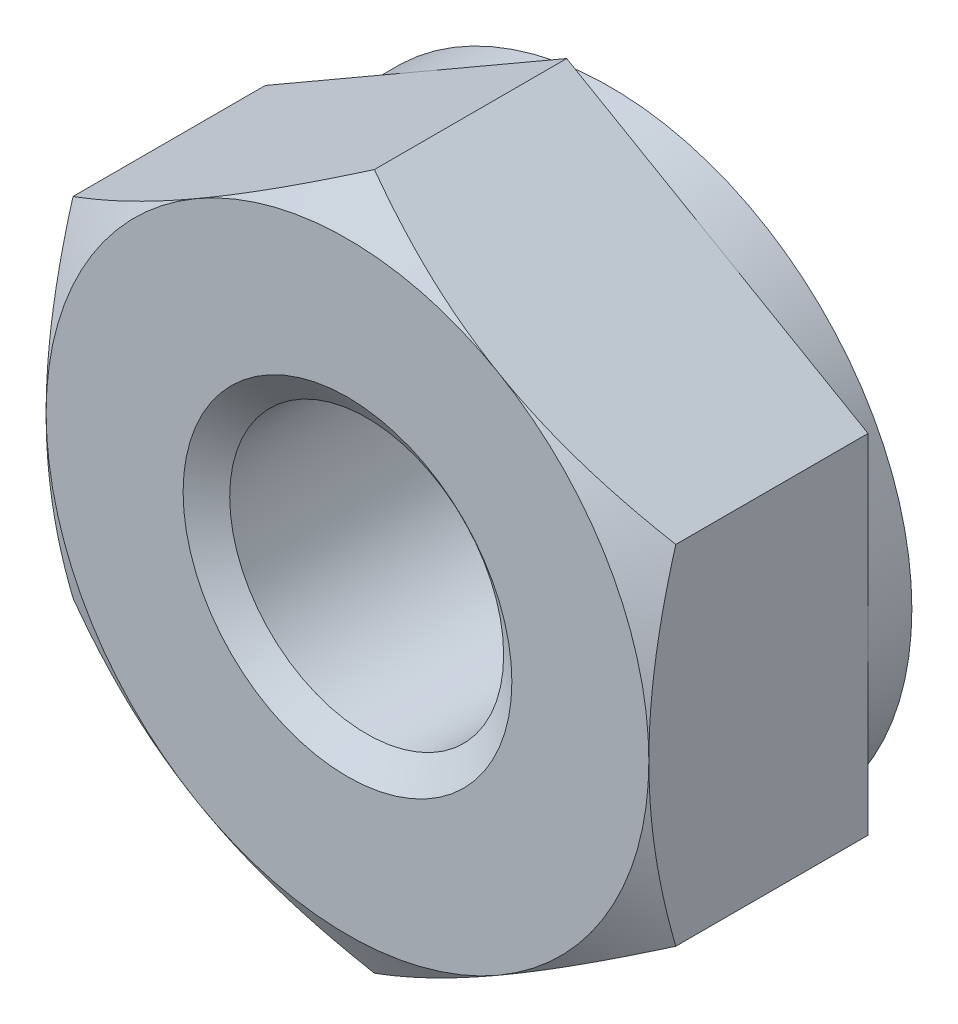
ISO-10303-21;
HEADER;
FILE_DESCRIPTION(('STEP AP214'),'2;1');
FILE_NAME('part.step','',(''),(''),'','','');
FILE_SCHEMA(('AUTOMOTIVE_DESIGN { 1 0 10303 214 1 1 1 1 }'));
ENDSEC;
DATA;
#1=APPLICATION_CONTEXT('core data for automotive mechanical design processes');
#2=APPLICATION_PROTOCOL_DEFINITION('international standard','automotive_design',2000,#1);
#3=PRODUCT_CONTEXT('',#1,'mechanical');
#4=PRODUCT('Part','Part','',(#3));
#5=PRODUCT_RELATED_PRODUCT_CATEGORY('part','',(#4));
#6=PRODUCT_DEFINITION_FORMATION('','',#4);
#7=PRODUCT_DEFINITION_CONTEXT('part definition',#1,'design');
#8=PRODUCT_DEFINITION('design','',#6,#7);
#9=PRODUCT_DEFINITION_SHAPE('','',#8);
#10=(LENGTH_UNIT() NAMED_UNIT(*) SI_UNIT(.MILLI.,.METRE.));
#11=(NAMED_UNIT(*) PLANE_ANGLE_UNIT() SI_UNIT($,.RADIAN.));
#12=(NAMED_UNIT(*) SI_UNIT($,.STERADIAN.) SOLID_ANGLE_UNIT());
#13=UNCERTAINTY_MEASURE_WITH_UNIT(LENGTH_MEASURE(1.E-05),#10,'distance_accuracy_value','');
#14=(GEOMETRIC_REPRESENTATION_CONTEXT(3) GLOBAL_UNCERTAINTY_ASSIGNED_CONTEXT((#13)) GLOBAL_UNIT_ASSIGNED_CONTEXT((#10,
#11,#12)) REPRESENTATION_CONTEXT('',''));
#15=CARTESIAN_POINT('',(0.,0.,0.));
#16=DIRECTION('',(0.,0.,1.));
#17=DIRECTION('',(1.,0.,0.));
#18=AXIS2_PLACEMENT_3D('',#15,#16,#17);
#19=CARTESIAN_POINT('',(0.,0.,-2.4));
#20=DIRECTION('',(0.,0.,1.));
#21=DIRECTION('',(1.,0.,0.));
#22=AXIS2_PLACEMENT_3D('',#19,#20,#21);
#23=CYLINDRICAL_SURFACE('',#22,1.25);
#24=CARTESIAN_POINT('',(0.,0.,-0.175051884552426));
#25=DIRECTION('',(0.,0.,1.));
#26=DIRECTION('',(1.,0.,0.));
#27=AXIS2_PLACEMENT_3D('',#24,#25,#26);
#28=CIRCLE('',#27,1.25);
#29=CARTESIAN_POINT('',(1.25,0.,-0.175051884552426));
#30=VERTEX_POINT('',#29);
#31=EDGE_CURVE('E151',#30,#30,#28,.F.);
#32=ORIENTED_EDGE('',*,*,#31,.F.);
#33=EDGE_LOOP('',(#32));
#34=FACE_BOUND('',#33,.T.);
#35=CARTESIAN_POINT('',(0.,0.,-2.19954811544757));
#36=DIRECTION('',(0.,0.,-1.));
#37=DIRECTION('',(-1.,0.,0.));
#38=AXIS2_PLACEMENT_3D('',#35,#36,#37);
#39=CIRCLE('',#38,1.25);
#40=CARTESIAN_POINT('',(-1.25,0.,-2.19954811544757));
#41=VERTEX_POINT('',#40);
#42=EDGE_CURVE('E39',#41,#41,#39,.F.);
#43=ORIENTED_EDGE('',*,*,#42,.F.);
#44=EDGE_LOOP('',(#43));
#45=FACE_BOUND('',#44,.T.);
#46=ADVANCED_FACE('F34',(#34,#45),#23,.F.);
#47=CARTESIAN_POINT('',(0.,3.17542648054295,-2.4));
#48=DIRECTION('',(0.,0.,-1.));
#49=DIRECTION('',(-1.,0.,0.));
#50=AXIS2_PLACEMENT_3D('',#47,#48,#49);
#51=PLANE('',#50);
#52=CARTESIAN_POINT('',(0.,0.,-2.4));
#53=DIRECTION('',(0.,0.,-1.));
#54=DIRECTION('',(-1.,0.,0.));
#55=AXIS2_PLACEMENT_3D('',#52,#53,#54);
#56=CIRCLE('',#55,2.75);
#57=CARTESIAN_POINT('',(-2.75,0.,-2.4));
#58=VERTEX_POINT('',#57);
#59=EDGE_CURVE('E278',#58,#58,#56,.F.);
#60=ORIENTED_EDGE('',*,*,#59,.F.);
#61=EDGE_LOOP('',(#60));
#62=FACE_BOUND('',#61,.T.);
#63=CARTESIAN_POINT('',(0.,0.,-2.4));
#64=DIRECTION('',(0.,0.,-1.));
#65=DIRECTION('',(-1.,0.,0.));
#66=AXIS2_PLACEMENT_3D('',#63,#64,#65);
#67=CIRCLE('',#66,1.5);
#68=CARTESIAN_POINT('',(-1.5,0.,-2.4));
#69=VERTEX_POINT('',#68);
#70=EDGE_CURVE('E298',#69,#69,#67,.F.);
#71=ORIENTED_EDGE('',*,*,#70,.T.);
#72=EDGE_LOOP('',(#71));
#73=FACE_BOUND('',#72,.T.);
#74=ADVANCED_FACE('F230',(#62,#73),#51,.T.);
#75=CARTESIAN_POINT('',(0.,3.17542648054295,0.));
#76=DIRECTION('',(0.,0.,-1.));
#77=DIRECTION('',(-1.,0.,0.));
#78=AXIS2_PLACEMENT_3D('',#75,#76,#77);
#79=PLANE('',#78);
#80=CARTESIAN_POINT('',(0.,0.,0.));
#81=DIRECTION('',(0.,0.,-1.));
#82=DIRECTION('',(-1.,0.,0.));
#83=AXIS2_PLACEMENT_3D('',#80,#81,#82);
#84=CIRCLE('',#83,2.75);
#85=CARTESIAN_POINT('',(-1.37500000000002,2.3815698604072,0.));
#86=VERTEX_POINT('',#85);
#87=CARTESIAN_POINT('',(-2.75,0.,0.));
#88=VERTEX_POINT('',#87);
#89=EDGE_CURVE('E46',#86,#88,#84,.F.);
#90=ORIENTED_EDGE('',*,*,#89,.T.);
#91=CARTESIAN_POINT('',(-1.37500000000003,-2.38156986040719,0.));
#92=VERTEX_POINT('',#91);
#93=EDGE_CURVE('E11',#88,#92,#84,.F.);
#94=ORIENTED_EDGE('',*,*,#93,.T.);
#95=CARTESIAN_POINT('',(1.37500000000001,-2.3815698604072,0.));
#96=VERTEX_POINT('',#95);
#97=EDGE_CURVE('E44',#92,#96,#84,.F.);
#98=ORIENTED_EDGE('',*,*,#97,.T.);
#99=CARTESIAN_POINT('',(2.75,0.,0.));
#100=VERTEX_POINT('',#99);
#101=EDGE_CURVE('E130',#96,#100,#84,.F.);
#102=ORIENTED_EDGE('',*,*,#101,.T.);
#103=CARTESIAN_POINT('',(0.,0.,0.));
#104=DIRECTION('',(0.,0.,1.));
#105=DIRECTION('',(1.,0.,0.));
#106=AXIS2_PLACEMENT_3D('',#103,#104,#105);
#107=CIRCLE('',#106,2.75);
#108=CARTESIAN_POINT('',(1.37500000000003,2.38156986040719,0.));
#109=VERTEX_POINT('',#108);
#110=EDGE_CURVE('E142',#100,#109,#107,.T.);
#111=ORIENTED_EDGE('',*,*,#110,.T.);
#112=EDGE_CURVE('E157',#109,#86,#84,.F.);
#113=ORIENTED_EDGE('',*,*,#112,.T.);
#114=EDGE_LOOP('',(#90,#94,#98,#102,#111,#113));
#115=FACE_BOUND('',#114,.T.);
#116=CARTESIAN_POINT('',(0.,0.,0.));
#117=DIRECTION('',(0.,0.,1.));
#118=DIRECTION('',(1.,0.,0.));
#119=AXIS2_PLACEMENT_3D('',#116,#117,#118);
#120=CIRCLE('',#119,1.5);
#121=CARTESIAN_POINT('',(1.5,0.,0.));
#122=VERTEX_POINT('',#121);
#123=EDGE_CURVE('E297',#122,#122,#120,.T.);
#124=ORIENTED_EDGE('',*,*,#123,.F.);
#125=EDGE_LOOP('',(#124));
#126=FACE_BOUND('',#125,.T.);
#127=ADVANCED_FACE('F154',(#115,#126),#79,.F.);
#128=CARTESIAN_POINT('',(0.,3.17542648054295,-2.4));
#129=DIRECTION('',(-0.500000000000006,0.866025403784435,0.));
#130=DIRECTION('',(-0.866025403784435,-0.500000000000006,0.));
#131=AXIS2_PLACEMENT_3D('',#128,#129,#130);
#132=PLANE('',#131);
#133=DIRECTION('',(0.,0.,1.));
#134=VECTOR('',#133,1.);
#135=CARTESIAN_POINT('',(-2.75,1.58771324027146,-2.4));
#136=LINE('',#135,#134);
#137=CARTESIAN_POINT('',(-2.75,1.58771324027146,-2.));
#138=VERTEX_POINT('',#137);
#139=CARTESIAN_POINT('',(-2.75,1.58771324027146,-0.24562009306187));
#140=VERTEX_POINT('',#139);
#141=EDGE_CURVE('E287',#138,#140,#136,.T.);
#142=ORIENTED_EDGE('',*,*,#141,.T.);
#143=CARTESIAN_POINT('',(-2.7502,1.58759777021762,-0.245686763364756));
#144=CARTESIAN_POINT('',(-2.62935077934009,1.65737010029697,-0.205387662249259));
#145=CARTESIAN_POINT('',(-2.50745839737737,1.72774469983532,-0.168736902597658));
#146=CARTESIAN_POINT('',(-2.26156287327211,1.86971254687002,-0.104762182969798));
#147=CARTESIAN_POINT('',(-2.13755536142615,1.94130831721582,-0.0774608556744947));
#148=CARTESIAN_POINT('',(-1.89107720202406,2.08361254889598,-0.0349617452941148));
#149=CARTESIAN_POINT('',(-1.76864448141259,2.15429911309863,-0.0194811186224561));
#150=CARTESIAN_POINT('',(-1.52320285763109,2.29600490065922,-0.000999397369939625));
#151=CARTESIAN_POINT('',(-1.4001948467671,2.36702360884403,0.00201700053740062));
#152=CARTESIAN_POINT('',(-1.17034121338921,2.49972966594897,-0.00425314542854701));
#153=CARTESIAN_POINT('',(-1.06346120874598,2.56143686540072,-0.012000154276703));
#154=CARTESIAN_POINT('',(-0.850397532665255,2.68444923614047,-0.0365551810643565));
#155=CARTESIAN_POINT('',(-0.744214598351115,2.74575398185008,-0.0533715896505727));
#156=CARTESIAN_POINT('',(-0.530711510606819,2.86902004703207,-0.0954119223459602));
#157=CARTESIAN_POINT('',(-0.423418383857147,2.93096576264319,-0.120814080687235));
#158=CARTESIAN_POINT('',(-0.210432520715949,3.05393320806135,-0.178467225839988));
#159=CARTESIAN_POINT('',(-0.104737054973347,3.11495651365996,-0.210704663298989));
#160=CARTESIAN_POINT('',(0.000200000000000649,3.17554195059679,-0.245686763364768));
#161=B_SPLINE_CURVE_WITH_KNOTS('',3,(#143,#144,#145,#146,#147,#148,#149,#150,#151,#152,#153,
#154,#155,#156,#157,#158,#159,#160),.UNSPECIFIED.,.F.,.F.,(4,2,2,2,2,2,2,2,4),(0.,
0.435912828725888,0.87287355711633,1.29901931904671,1.72464171213573,2.09526089052938,
2.46622354066375,2.84541551798558,3.22386274754526),.UNSPECIFIED.);
#162=EDGE_CURVE('E58',#140,#86,#161,.T.);
#163=ORIENTED_EDGE('',*,*,#162,.T.);
#164=CARTESIAN_POINT('',(0.,3.17542648054296,-0.24562009306187));
#165=VERTEX_POINT('',#164);
#166=EDGE_CURVE('E166',#86,#165,#161,.T.);
#167=ORIENTED_EDGE('',*,*,#166,.T.);
#168=DIRECTION('',(0.,0.,1.));
#169=VECTOR('',#168,1.);
#170=CARTESIAN_POINT('',(0.,3.17542648054295,-2.4));
#171=LINE('',#170,#169);
#172=CARTESIAN_POINT('',(0.,3.17542648054295,-2.));
#173=VERTEX_POINT('',#172);
#174=EDGE_CURVE('E275',#173,#165,#171,.T.);
#175=ORIENTED_EDGE('',*,*,#174,.F.);
#176=DIRECTION('',(-0.866025403784435,-0.500000000000006,0.));
#177=VECTOR('',#176,1.);
#178=CARTESIAN_POINT('',(0.,3.17542648054295,-2.));
#179=LINE('',#178,#177);
#180=CARTESIAN_POINT('',(-1.37500000000002,2.3815698604072,-2.00000000000001));
#181=VERTEX_POINT('',#180);
#182=EDGE_CURVE('E263',#173,#181,#179,.T.);
#183=ORIENTED_EDGE('',*,*,#182,.T.);
#184=EDGE_CURVE('E259',#181,#138,#179,.T.);
#185=ORIENTED_EDGE('',*,*,#184,.T.);
#186=EDGE_LOOP('',(#142,#163,#167,#175,#183,#185));
#187=FACE_BOUND('',#186,.T.);
#188=ADVANCED_FACE('F36',(#187),#132,.T.);
#189=CARTESIAN_POINT('',(2.75,1.58771324027144,-2.4));
#190=DIRECTION('',(0.500000000000011,0.866025403784433,0.));
#191=DIRECTION('',(-0.866025403784433,0.500000000000011,0.));
#192=AXIS2_PLACEMENT_3D('',#189,#190,#191);
#193=PLANE('',#192);
#194=ORIENTED_EDGE('',*,*,#174,.T.);
#195=CARTESIAN_POINT('',(-0.000199999999999266,3.17554195059679,-0.245686763364768));
#196=CARTESIAN_POINT('',(0.120649220659906,3.10576962051744,-0.20538766224927));
#197=CARTESIAN_POINT('',(0.242541602622633,3.03539502097909,-0.168736902597668));
#198=CARTESIAN_POINT('',(0.488437126727891,2.89342717394439,-0.104762182969805));
#199=CARTESIAN_POINT('',(0.612444638573854,2.82183140359859,-0.0774608556745));
#200=CARTESIAN_POINT('',(0.858922797975941,2.67952717191843,-0.0349617452941173));
#201=CARTESIAN_POINT('',(0.981355518587414,2.60884060771577,-0.0194811186224572));
#202=CARTESIAN_POINT('',(1.22679714236891,2.46713482015518,-0.000999397369937717));
#203=CARTESIAN_POINT('',(1.34980515323291,2.39611611197037,0.00201700053740402));
#204=CARTESIAN_POINT('',(1.57965878661079,2.26341005486543,-0.00425314542854105));
#205=CARTESIAN_POINT('',(1.68653879125402,2.20170285541368,-0.0120001542766958));
#206=CARTESIAN_POINT('',(1.89960246733475,2.07869048467393,-0.036555181064347));
#207=CARTESIAN_POINT('',(2.00578540164888,2.01738573896432,-0.0533715896505621));
#208=CARTESIAN_POINT('',(2.21928848939318,1.89411967378233,-0.0954119223459474));
#209=CARTESIAN_POINT('',(2.32658161614285,1.83217395817121,-0.120814080687222));
#210=CARTESIAN_POINT('',(2.53956747928405,1.70920651275305,-0.178467225839972));
#211=CARTESIAN_POINT('',(2.64526294502665,1.64818320715443,-0.210704663298972));
#212=CARTESIAN_POINT('',(2.7502,1.5875977702176,-0.24568676336475));
#213=B_SPLINE_CURVE_WITH_KNOTS('',3,(#195,#196,#197,#198,#199,#200,#201,#202,#203,#204,#205,
#206,#207,#208,#209,#210,#211,#212),.UNSPECIFIED.,.F.,.F.,(4,2,2,2,2,2,2,2,4),(0.,
0.43591282872589,0.872873557116336,1.29901931904672,1.72464171213574,2.09526089052939,
2.46622354066376,2.84541551798559,3.22386274754526),.UNSPECIFIED.);
#214=EDGE_CURVE('E163',#165,#109,#213,.T.);
#215=ORIENTED_EDGE('',*,*,#214,.T.);
#216=CARTESIAN_POINT('',(2.75,1.5877132402715,-0.24562009306187));
#217=VERTEX_POINT('',#216);
#218=EDGE_CURVE('E145',#109,#217,#213,.T.);
#219=ORIENTED_EDGE('',*,*,#218,.T.);
#220=DIRECTION('',(0.,0.,1.));
#221=VECTOR('',#220,1.);
#222=CARTESIAN_POINT('',(2.75,1.58771324027144,-2.4));
#223=LINE('',#222,#221);
#224=CARTESIAN_POINT('',(2.75,1.58771324027144,-2.));
#225=VERTEX_POINT('',#224);
#226=EDGE_CURVE('E162',#225,#217,#223,.T.);
#227=ORIENTED_EDGE('',*,*,#226,.F.);
#228=DIRECTION('',(-0.866025403784433,0.500000000000011,0.));
#229=VECTOR('',#228,1.);
#230=CARTESIAN_POINT('',(2.75,1.58771324027144,-2.));
#231=LINE('',#230,#229);
#232=CARTESIAN_POINT('',(1.37500000000003,2.38156986040718,-2.00000000000001));
#233=VERTEX_POINT('',#232);
#234=EDGE_CURVE('E271',#225,#233,#231,.T.);
#235=ORIENTED_EDGE('',*,*,#234,.T.);
#236=EDGE_CURVE('E267',#233,#173,#231,.T.);
#237=ORIENTED_EDGE('',*,*,#236,.T.);
#238=EDGE_LOOP('',(#194,#215,#219,#227,#235,#237));
#239=FACE_BOUND('',#238,.T.);
#240=ADVANCED_FACE('F243',(#239),#193,.T.);
#241=CARTESIAN_POINT('',(2.75,1.58771324027144,-2.4));
#242=DIRECTION('',(-1.,0.,0.));
#243=DIRECTION('',(0.,0.,1.));
#244=AXIS2_PLACEMENT_3D('',#241,#242,#243);
#245=PLANE('',#244);
#246=CARTESIAN_POINT('',(2.75,-4.2108494930968,-1.31594843960295));
#247=CARTESIAN_POINT('',(2.75,-4.09010894214094,-1.25759993615226));
#248=CARTESIAN_POINT('',(2.75,-3.96908292065513,-1.1998314651176));
#249=CARTESIAN_POINT('',(2.75,-3.72630558284848,-1.08578603842306));
#250=CARTESIAN_POINT('',(2.75,-3.60455414536204,-1.02950934100248));
#251=CARTESIAN_POINT('',(2.75,-3.35951393034359,-0.918482443352771));
#252=CARTESIAN_POINT('',(2.75,-3.2362203423644,-0.863742821605852));
#253=CARTESIAN_POINT('',(2.75,-2.98861980138747,-0.756614777476467));
#254=CARTESIAN_POINT('',(2.75,-2.86431290161186,-0.704226232536776));
#255=CARTESIAN_POINT('',(2.75,-2.61294485887176,-0.601803572146136));
#256=CARTESIAN_POINT('',(2.75,-2.48586863815658,-0.551806257898405));
#257=CARTESIAN_POINT('',(2.75,-2.23021732171545,-0.455727408784612));
#258=CARTESIAN_POINT('',(2.75,-2.10164206103367,-0.409646309576982));
#259=CARTESIAN_POINT('',(2.75,-1.84305218799471,-0.32263807704624));
#260=CARTESIAN_POINT('',(2.75,-1.71304130052587,-0.281699986413897));
#261=CARTESIAN_POINT('',(2.75,-1.45117125062151,-0.206307307624355));
#262=CARTESIAN_POINT('',(2.75,-1.31931268690206,-0.171850669152774));
#263=CARTESIAN_POINT('',(2.75,-1.05365722480016,-0.111093671530909));
#264=CARTESIAN_POINT('',(2.75,-0.919859820217627,-0.0847954840951257));
#265=CARTESIAN_POINT('',(2.75,-0.650651874037416,-0.0421260371966137));
#266=CARTESIAN_POINT('',(2.75,-0.51524133101363,-0.0257547865105446));
#267=CARTESIAN_POINT('',(2.75,-0.244373242869245,-0.00438749654023727));
#268=CARTESIAN_POINT('',(2.75,-0.108921526377167,0.000680556773217004));
#269=CARTESIAN_POINT('',(2.75,0.161887058855101,-0.000827795632669049));
#270=CARTESIAN_POINT('',(2.75,0.297243943089608,-0.00740117868554976));
#271=CARTESIAN_POINT('',(2.75,0.528385436717509,-0.0281041300468381));
#272=CARTESIAN_POINT('',(2.75,0.624425050137466,-0.0395376410301817));
#273=CARTESIAN_POINT('',(2.75,0.815762399811508,-0.0675217196133428));
#274=CARTESIAN_POINT('',(2.75,0.91106001663193,-0.0840730942276734));
#275=CARTESIAN_POINT('',(2.75,1.19576218748913,-0.140535361278273));
#276=CARTESIAN_POINT('',(2.75,1.38383224738493,-0.187239859417281));
#277=CARTESIAN_POINT('',(2.75,1.66525048947481,-0.267792497030563));
#278=CARTESIAN_POINT('',(2.75,1.76006556248554,-0.296803334995485));
#279=CARTESIAN_POINT('',(2.75,1.94870609382211,-0.357695648906571));
#280=CARTESIAN_POINT('',(2.75,2.04253218553692,-0.389575144878486));
#281=CARTESIAN_POINT('',(2.75,2.2288024035498,-0.455541418186429));
#282=CARTESIAN_POINT('',(2.75,2.32125133588447,-0.489614761455512));
#283=CARTESIAN_POINT('',(2.75,2.50543192042624,-0.559761368231088));
#284=CARTESIAN_POINT('',(2.75,2.59716326539574,-0.595835440037296));
#285=CARTESIAN_POINT('',(2.75,2.68856293053341,-0.632712441997461));
#286=B_SPLINE_CURVE_WITH_KNOTS('',3,(#246,#247,#248,#249,#250,#251,#252,#253,#254,#255,#256,
#257,#258,#259,#260,#261,#262,#263,#264,#265,#266,#267,#268,#269,#270,#271,#272,#273,#274,#275,
#276,#277,#278,#279,#280,#281,#282,#283,#284,#285),.UNSPECIFIED.,.F.,.F.,(4,2,2,2,2,2,2,2,2,2,2,
2,2,2,2,2,2,2,2,4),(0.,0.402305607365937,0.804680408536997,1.20935783819118,1.61401414820819,
2.0236383818577,2.43330812457349,2.84208969479601,3.25074173456637,3.65950246109144,
4.06826354901185,4.47441284024651,4.88045669141173,5.17046846817547,5.46052599902453,
6.04107275309883,6.33851131304661,6.63574613017454,6.93130791005792,7.22698998004822),.UNSPECIFIED.);
#287=CARTESIAN_POINT('',(2.74999999999999,-1.58771324027152,-0.24562009306187));
#288=VERTEX_POINT('',#287);
#289=EDGE_CURVE('E126',#288,#100,#286,.T.);
#290=ORIENTED_EDGE('',*,*,#289,.F.);
#291=DIRECTION('',(0.,0.,1.));
#292=VECTOR('',#291,1.);
#293=CARTESIAN_POINT('',(2.75,-1.58771324027151,-2.4));
#294=LINE('',#293,#292);
#295=CARTESIAN_POINT('',(2.75,-1.58771324027151,-2.));
#296=VERTEX_POINT('',#295);
#297=EDGE_CURVE('E280',#296,#288,#294,.T.);
#298=ORIENTED_EDGE('',*,*,#297,.F.);
#299=DIRECTION('',(0.,-1.,0.));
#300=VECTOR('',#299,1.);
#301=CARTESIAN_POINT('',(2.75,1.58771324027144,-2.));
#302=LINE('',#301,#300);
#303=CARTESIAN_POINT('',(2.75,0.,-2.00000000000001));
#304=VERTEX_POINT('',#303);
#305=EDGE_CURVE('E272',#304,#296,#302,.T.);
#306=ORIENTED_EDGE('',*,*,#305,.F.);
#307=EDGE_CURVE('E274',#225,#304,#302,.T.);
#308=ORIENTED_EDGE('',*,*,#307,.F.);
#309=ORIENTED_EDGE('',*,*,#226,.T.);
#310=EDGE_CURVE('E139',#100,#217,#286,.T.);
#311=ORIENTED_EDGE('',*,*,#310,.F.);
#312=EDGE_LOOP('',(#290,#298,#306,#308,#309,#311));
#313=FACE_BOUND('',#312,.T.);
#314=ADVANCED_FACE('F159',(#313),#245,.F.);
#315=CARTESIAN_POINT('',(0.,-3.17542648054301,-2.4));
#316=DIRECTION('',(0.500000000000005,-0.866025403784435,0.));
#317=DIRECTION('',(0.866025403784436,0.500000000000006,0.));
#318=AXIS2_PLACEMENT_3D('',#315,#316,#317);
#319=PLANE('',#318);
#320=ORIENTED_EDGE('',*,*,#297,.T.);
#321=CARTESIAN_POINT('',(2.7502,-1.58759777021767,-0.24568676336477));
#322=CARTESIAN_POINT('',(2.62935077934009,-1.65737010029703,-0.205387662249274));
#323=CARTESIAN_POINT('',(2.50745839737736,-1.72774469983538,-0.168736902597674));
#324=CARTESIAN_POINT('',(2.2615628732721,-1.86971254687007,-0.104762182969815));
#325=CARTESIAN_POINT('',(2.13755536142614,-1.94130831721588,-0.0774608556745132));
#326=CARTESIAN_POINT('',(1.89107720202405,-2.08361254889604,-0.0349617452941355));
#327=CARTESIAN_POINT('',(1.76864448141257,-2.15429911309869,-0.0194811186224779));
#328=CARTESIAN_POINT('',(1.52320285763108,-2.29600490065928,-0.000999397369963684));
#329=CARTESIAN_POINT('',(1.40019484676708,-2.36702360884409,0.00201700053737531));
#330=CARTESIAN_POINT('',(1.1703412133892,-2.49972966594903,-0.00425314542857469));
#331=CARTESIAN_POINT('',(1.06346120874597,-2.56143686540078,-0.0120001542767316));
#332=CARTESIAN_POINT('',(0.850397532665241,-2.68444923614053,-0.0365551810643864));
#333=CARTESIAN_POINT('',(0.744214598351102,-2.74575398185014,-0.053371589650603));
#334=CARTESIAN_POINT('',(0.530711510606809,-2.86902004703213,-0.095411922345991));
#335=CARTESIAN_POINT('',(0.423418383857138,-2.93096576264325,-0.120814080687266));
#336=CARTESIAN_POINT('',(0.210432520715943,-3.0539332080614,-0.178467225840019));
#337=CARTESIAN_POINT('',(0.104737054973342,-3.11495651366001,-0.21070466329902));
#338=CARTESIAN_POINT('',(-0.000200000000005155,-3.17554195059684,-0.245686763364798));
#339=B_SPLINE_CURVE_WITH_KNOTS('',3,(#321,#322,#323,#324,#325,#326,#327,#328,#329,#330,#331,
#332,#333,#334,#335,#336,#337,#338),.UNSPECIFIED.,.F.,.F.,(4,2,2,2,2,2,2,2,4),(0.,
0.435912828725891,0.872873557116337,1.29901931904672,1.72464171213575,2.09526089052939,
2.46622354066375,2.84541551798558,3.22386274754525),.UNSPECIFIED.);
#340=EDGE_CURVE('E133',#288,#96,#339,.T.);
#341=ORIENTED_EDGE('',*,*,#340,.T.);
#342=CARTESIAN_POINT('',(0.,-3.17542648054295,-0.24562009306187));
#343=VERTEX_POINT('',#342);
#344=EDGE_CURVE('E173',#96,#343,#339,.T.);
#345=ORIENTED_EDGE('',*,*,#344,.T.);
#346=DIRECTION('',(0.,0.,1.));
#347=VECTOR('',#346,1.);
#348=CARTESIAN_POINT('',(0.,-3.17542648054301,-2.4));
#349=LINE('',#348,#347);
#350=CARTESIAN_POINT('',(0.,-3.17542648054301,-2.));
#351=VERTEX_POINT('',#350);
#352=EDGE_CURVE('E282',#351,#343,#349,.T.);
#353=ORIENTED_EDGE('',*,*,#352,.F.);
#354=DIRECTION('',(0.866025403784436,0.500000000000006,0.));
#355=VECTOR('',#354,1.);
#356=CARTESIAN_POINT('',(0.,-3.17542648054301,-2.));
#357=LINE('',#356,#355);
#358=CARTESIAN_POINT('',(1.37500000000004,-2.38156986040724,-2.00000000000001));
#359=VERTEX_POINT('',#358);
#360=EDGE_CURVE('E264',#351,#359,#357,.T.);
#361=ORIENTED_EDGE('',*,*,#360,.T.);
#362=EDGE_CURVE('E268',#359,#296,#357,.T.);
#363=ORIENTED_EDGE('',*,*,#362,.T.);
#364=EDGE_LOOP('',(#320,#341,#345,#353,#361,#363));
#365=FACE_BOUND('',#364,.T.);
#366=ADVANCED_FACE('F216',(#365),#319,.T.);
#367=CARTESIAN_POINT('',(-2.75,-1.5877132402715,-2.4));
#368=DIRECTION('',(-0.500000000000009,-0.866025403784433,0.));
#369=DIRECTION('',(0.866025403784433,-0.500000000000009,0.));
#370=AXIS2_PLACEMENT_3D('',#367,#368,#369);
#371=PLANE('',#370);
#372=ORIENTED_EDGE('',*,*,#352,.T.);
#373=CARTESIAN_POINT('',(0.000199999999994648,-3.17554195059684,-0.245686763364798));
#374=CARTESIAN_POINT('',(-0.120649220659913,-3.10576962051749,-0.205387662249299));
#375=CARTESIAN_POINT('',(-0.242541602622642,-3.03539502097914,-0.168736902597697));
#376=CARTESIAN_POINT('',(-0.488437126727904,-2.89342717394444,-0.104762182969833));
#377=CARTESIAN_POINT('',(-0.612444638573869,-2.82183140359863,-0.0774608556745285));
#378=CARTESIAN_POINT('',(-0.85892279797596,-2.67952717191847,-0.0349617452941454));
#379=CARTESIAN_POINT('',(-0.981355518587436,-2.60884060771581,-0.0194811186224851));
#380=CARTESIAN_POINT('',(-1.22679714236894,-2.46713482015522,-0.000999397369965649));
#381=CARTESIAN_POINT('',(-1.34980515323294,-2.39611611197041,0.00201700053737585));
#382=CARTESIAN_POINT('',(-1.57965878661082,-2.26341005486547,-0.00425314542856968));
#383=CARTESIAN_POINT('',(-1.68653879125404,-2.20170285541372,-0.0120001542767243));
#384=CARTESIAN_POINT('',(-1.89960246733477,-2.07869048467398,-0.0365551810643746));
#385=CARTESIAN_POINT('',(-2.0057854016489,-2.01738573896436,-0.053371589650589));
#386=CARTESIAN_POINT('',(-2.21928848939319,-1.89411967378238,-0.0954119223459725));
#387=CARTESIAN_POINT('',(-2.32658161614286,-1.83217395817126,-0.120814080687245));
#388=CARTESIAN_POINT('',(-2.53956747928405,-1.7092065127531,-0.178467225839993));
#389=CARTESIAN_POINT('',(-2.64526294502665,-1.64818320715449,-0.210704663298992));
#390=CARTESIAN_POINT('',(-2.7502,-1.58759777021766,-0.245686763364768));
#391=B_SPLINE_CURVE_WITH_KNOTS('',3,(#373,#374,#375,#376,#377,#378,#379,#380,#381,#382,#383,
#384,#385,#386,#387,#388,#389,#390),.UNSPECIFIED.,.F.,.F.,(4,2,2,2,2,2,2,2,4),(0.,
0.435912828725897,0.87287355711635,1.29901931904674,1.72464171213577,2.09526089052941,
2.46622354066377,2.84541551798559,3.22386274754525),.UNSPECIFIED.);
#392=EDGE_CURVE('E210',#343,#92,#391,.T.);
#393=ORIENTED_EDGE('',*,*,#392,.T.);
#394=CARTESIAN_POINT('',(-2.75,-1.5877132402715,-0.24562009306187));
#395=VERTEX_POINT('',#394);
#396=EDGE_CURVE('E203',#92,#395,#391,.T.);
#397=ORIENTED_EDGE('',*,*,#396,.T.);
#398=DIRECTION('',(0.,0.,1.));
#399=VECTOR('',#398,1.);
#400=CARTESIAN_POINT('',(-2.75,-1.5877132402715,-2.4));
#401=LINE('',#400,#399);
#402=CARTESIAN_POINT('',(-2.75,-1.5877132402715,-2.));
#403=VERTEX_POINT('',#402);
#404=EDGE_CURVE('E285',#403,#395,#401,.T.);
#405=ORIENTED_EDGE('',*,*,#404,.F.);
#406=DIRECTION('',(0.866025403784433,-0.500000000000009,0.));
#407=VECTOR('',#406,1.);
#408=CARTESIAN_POINT('',(-2.75,-1.5877132402715,-2.));
#409=LINE('',#408,#407);
#410=CARTESIAN_POINT('',(-1.37500000000005,-2.38156986040723,-2.00000000000001));
#411=VERTEX_POINT('',#410);
#412=EDGE_CURVE('E254',#403,#411,#409,.T.);
#413=ORIENTED_EDGE('',*,*,#412,.T.);
#414=EDGE_CURVE('E260',#411,#351,#409,.T.);
#415=ORIENTED_EDGE('',*,*,#414,.T.);
#416=EDGE_LOOP('',(#372,#393,#397,#405,#413,#415));
#417=FACE_BOUND('',#416,.T.);
#418=ADVANCED_FACE('F212',(#417),#371,.T.);
#419=CARTESIAN_POINT('',(-2.75,1.58771324027146,-2.4));
#420=DIRECTION('',(-1.,0.,0.));
#421=DIRECTION('',(0.,0.,1.));
#422=AXIS2_PLACEMENT_3D('',#419,#420,#421);
#423=PLANE('',#422);
#424=ORIENTED_EDGE('',*,*,#404,.T.);
#425=CARTESIAN_POINT('',(-2.75,-4.21084949309679,-1.31594843960295));
#426=CARTESIAN_POINT('',(-2.75,-4.09010894214093,-1.25759993615225));
#427=CARTESIAN_POINT('',(-2.75,-3.96908292065512,-1.1998314651176));
#428=CARTESIAN_POINT('',(-2.75,-3.72630558284847,-1.08578603842306));
#429=CARTESIAN_POINT('',(-2.75,-3.60455414536203,-1.02950934100248));
#430=CARTESIAN_POINT('',(-2.75,-3.35951393034357,-0.918482443352767));
#431=CARTESIAN_POINT('',(-2.75,-3.23622034236439,-0.863742821605848));
#432=CARTESIAN_POINT('',(-2.75,-2.98861980138746,-0.756614777476464));
#433=CARTESIAN_POINT('',(-2.75,-2.86431290161185,-0.704226232536773));
#434=CARTESIAN_POINT('',(-2.75,-2.61294485887175,-0.601803572146132));
#435=CARTESIAN_POINT('',(-2.75,-2.48586863815657,-0.551806257898402));
#436=CARTESIAN_POINT('',(-2.75,-2.23021732171543,-0.455727408784609));
#437=CARTESIAN_POINT('',(-2.75,-2.10164206103366,-0.409646309576979));
#438=CARTESIAN_POINT('',(-2.75,-1.8430521879947,-0.322638077046238));
#439=CARTESIAN_POINT('',(-2.75,-1.71304130052586,-0.281699986413895));
#440=CARTESIAN_POINT('',(-2.75,-1.4511712506215,-0.206307307624354));
#441=CARTESIAN_POINT('',(-2.75,-1.31931268690205,-0.171850669152773));
#442=CARTESIAN_POINT('',(-2.75,-1.05365722480015,-0.111093671530908));
#443=CARTESIAN_POINT('',(-2.75,-0.919859820217615,-0.0847954840951254));
#444=CARTESIAN_POINT('',(-2.75,-0.650651874037404,-0.042126037196614));
#445=CARTESIAN_POINT('',(-2.75,-0.515241331013618,-0.0257547865105454));
#446=CARTESIAN_POINT('',(-2.75,-0.244373242869233,-0.00438749654023852));
#447=CARTESIAN_POINT('',(-2.75,-0.108921526377155,0.000680556773215594));
#448=CARTESIAN_POINT('',(-2.75,0.161887058855113,-0.000827795632671145));
#449=CARTESIAN_POINT('',(-2.75,0.297243943089619,-0.00740117868555237));
#450=CARTESIAN_POINT('',(-2.75,0.528385436717521,-0.0281041300468415));
#451=CARTESIAN_POINT('',(-2.75,0.624425050137479,-0.0395376410301854));
#452=CARTESIAN_POINT('',(-2.75,0.815762399811522,-0.0675217196133471));
#453=CARTESIAN_POINT('',(-2.75,0.911060016631944,-0.0840730942276779));
#454=CARTESIAN_POINT('',(-2.75,1.19576218748914,-0.140535361278278));
#455=CARTESIAN_POINT('',(-2.75,1.38383224738494,-0.187239859417287));
#456=CARTESIAN_POINT('',(-2.75,1.66525048947483,-0.26779249703057));
#457=CARTESIAN_POINT('',(-2.75,1.76006556248555,-0.296803334995492));
#458=CARTESIAN_POINT('',(-2.75,1.94870609382213,-0.357695648906578));
#459=CARTESIAN_POINT('',(-2.75,2.04253218553693,-0.389575144878493));
#460=CARTESIAN_POINT('',(-2.75,2.22880240354982,-0.455541418186437));
#461=CARTESIAN_POINT('',(-2.75,2.32125133588449,-0.489614761455521));
#462=CARTESIAN_POINT('',(-2.75,2.50543192042626,-0.559761368231097));
#463=CARTESIAN_POINT('',(-2.75,2.59716326539576,-0.595835440037305));
#464=CARTESIAN_POINT('',(-2.75,2.68856293053343,-0.632712441997471));
#465=B_SPLINE_CURVE_WITH_KNOTS('',3,(#425,#426,#427,#428,#429,#430,#431,#432,#433,#434,#435,
#436,#437,#438,#439,#440,#441,#442,#443,#444,#445,#446,#447,#448,#449,#450,#451,#452,#453,#454,
#455,#456,#457,#458,#459,#460,#461,#462,#463,#464),.UNSPECIFIED.,.F.,.F.,(4,2,2,2,2,2,2,2,2,2,2,
2,2,2,2,2,2,2,2,4),(0.,0.402305607365937,0.804680408536998,1.20935783819118,1.61401414820819,
2.0236383818577,2.43330812457349,2.84208969479601,3.25074173456637,3.65950246109144,
4.06826354901185,4.47441284024651,4.88045669141173,5.17046846817547,5.46052599902453,
6.04107275309884,6.33851131304662,6.63574613017455,6.93130791005792,7.22698998004823),.UNSPECIFIED.);
#466=EDGE_CURVE('E211',#395,#88,#465,.T.);
#467=ORIENTED_EDGE('',*,*,#466,.T.);
#468=EDGE_CURVE('E150',#88,#140,#465,.T.);
#469=ORIENTED_EDGE('',*,*,#468,.T.);
#470=ORIENTED_EDGE('',*,*,#141,.F.);
#471=DIRECTION('',(0.,-1.,0.));
#472=VECTOR('',#471,1.);
#473=CARTESIAN_POINT('',(-2.75,1.58771324027146,-2.));
#474=LINE('',#473,#472);
#475=CARTESIAN_POINT('',(-2.75,0.,-2.00000000000001));
#476=VERTEX_POINT('',#475);
#477=EDGE_CURVE('E294',#138,#476,#474,.T.);
#478=ORIENTED_EDGE('',*,*,#477,.T.);
#479=EDGE_CURVE('E292',#476,#403,#474,.T.);
#480=ORIENTED_EDGE('',*,*,#479,.T.);
#481=EDGE_LOOP('',(#424,#467,#469,#470,#478,#480));
#482=FACE_BOUND('',#481,.T.);
#483=ADVANCED_FACE('F215',(#482),#423,.T.);
#484=CARTESIAN_POINT('',(0.,13.175426480543,-2.));
#485=DIRECTION('',(0.,0.,-1.));
#486=DIRECTION('',(-1.,0.,0.));
#487=AXIS2_PLACEMENT_3D('',#484,#485,#486);
#488=PLANE('',#487);
#489=ORIENTED_EDGE('',*,*,#307,.T.);
#490=CARTESIAN_POINT('',(0.,0.,-2.00000000000001));
#491=DIRECTION('',(0.,0.,1.));
#492=DIRECTION('',(1.,0.,0.));
#493=AXIS2_PLACEMENT_3D('',#490,#491,#492);
#494=CIRCLE('',#493,2.75);
#495=EDGE_CURVE('E251',#304,#233,#494,.T.);
#496=ORIENTED_EDGE('',*,*,#495,.T.);
#497=ORIENTED_EDGE('',*,*,#234,.F.);
#498=EDGE_LOOP('',(#489,#496,#497));
#499=FACE_BOUND('',#498,.T.);
#500=ADVANCED_FACE('F221',(#499),#488,.T.);
#501=ORIENTED_EDGE('',*,*,#305,.T.);
#502=ORIENTED_EDGE('',*,*,#362,.F.);
#503=EDGE_CURVE('E256',#359,#304,#494,.T.);
#504=ORIENTED_EDGE('',*,*,#503,.T.);
#505=EDGE_LOOP('',(#501,#502,#504));
#506=FACE_BOUND('',#505,.T.);
#507=ADVANCED_FACE('F226',(#506),#488,.T.);
#508=EDGE_CURVE('E255',#233,#181,#494,.T.);
#509=ORIENTED_EDGE('',*,*,#508,.T.);
#510=ORIENTED_EDGE('',*,*,#182,.F.);
#511=ORIENTED_EDGE('',*,*,#236,.F.);
#512=EDGE_LOOP('',(#509,#510,#511));
#513=FACE_BOUND('',#512,.T.);
#514=ADVANCED_FACE('F435',(#513),#488,.T.);
#515=ORIENTED_EDGE('',*,*,#414,.F.);
#516=EDGE_CURVE('E507',#411,#359,#494,.T.);
#517=ORIENTED_EDGE('',*,*,#516,.T.);
#518=ORIENTED_EDGE('',*,*,#360,.F.);
#519=EDGE_LOOP('',(#515,#517,#518));
#520=FACE_BOUND('',#519,.T.);
#521=ADVANCED_FACE('F426',(#520),#488,.T.);
#522=EDGE_CURVE('E524',#181,#476,#494,.T.);
#523=ORIENTED_EDGE('',*,*,#522,.T.);
#524=ORIENTED_EDGE('',*,*,#477,.F.);
#525=ORIENTED_EDGE('',*,*,#184,.F.);
#526=EDGE_LOOP('',(#523,#524,#525));
#527=FACE_BOUND('',#526,.T.);
#528=ADVANCED_FACE('F410',(#527),#488,.T.);
#529=CARTESIAN_POINT('',(0.,0.,0.));
#530=DIRECTION('',(0.,0.,1.));
#531=DIRECTION('',(1.,0.,0.));
#532=AXIS2_PLACEMENT_3D('',#529,#530,#531);
#533=CYLINDRICAL_SURFACE('',#532,2.75);
#534=ORIENTED_EDGE('',*,*,#59,.T.);
#535=EDGE_LOOP('',(#534));
#536=FACE_BOUND('',#535,.T.);
#537=ORIENTED_EDGE('',*,*,#508,.F.);
#538=ORIENTED_EDGE('',*,*,#495,.F.);
#539=ORIENTED_EDGE('',*,*,#503,.F.);
#540=ORIENTED_EDGE('',*,*,#516,.F.);
#541=EDGE_CURVE('E519',#476,#411,#494,.T.);
#542=ORIENTED_EDGE('',*,*,#541,.F.);
#543=ORIENTED_EDGE('',*,*,#522,.F.);
#544=EDGE_LOOP('',(#537,#538,#539,#540,#542,#543));
#545=FACE_BOUND('',#544,.T.);
#546=ADVANCED_FACE('F240',(#536,#545),#533,.T.);
#547=ORIENTED_EDGE('',*,*,#479,.F.);
#548=ORIENTED_EDGE('',*,*,#541,.T.);
#549=ORIENTED_EDGE('',*,*,#412,.F.);
#550=EDGE_LOOP('',(#547,#548,#549));
#551=FACE_BOUND('',#550,.T.);
#552=ADVANCED_FACE('F193',(#551),#488,.T.);
#553=CARTESIAN_POINT('',(0.,0.,0.));
#554=DIRECTION('',(0.,0.,-1.));
#555=DIRECTION('',(-1.,0.,0.));
#556=AXIS2_PLACEMENT_3D('',#553,#554,#555);
#557=CONICAL_SURFACE('',#556,2.75,1.0471975511966);
#558=ORIENTED_EDGE('',*,*,#468,.F.);
#559=ORIENTED_EDGE('',*,*,#89,.F.);
#560=ORIENTED_EDGE('',*,*,#162,.F.);
#561=EDGE_LOOP('',(#558,#559,#560));
#562=FACE_BOUND('',#561,.T.);
#563=ADVANCED_FACE('F372',(#562),#557,.T.);
#564=ORIENTED_EDGE('',*,*,#112,.F.);
#565=ORIENTED_EDGE('',*,*,#214,.F.);
#566=ORIENTED_EDGE('',*,*,#166,.F.);
#567=EDGE_LOOP('',(#564,#565,#566));
#568=FACE_BOUND('',#567,.T.);
#569=ADVANCED_FACE('F191',(#568),#557,.T.);
#570=ORIENTED_EDGE('',*,*,#110,.F.);
#571=ORIENTED_EDGE('',*,*,#310,.T.);
#572=ORIENTED_EDGE('',*,*,#218,.F.);
#573=EDGE_LOOP('',(#570,#571,#572));
#574=FACE_BOUND('',#573,.T.);
#575=ADVANCED_FACE('F143',(#574),#557,.T.);
#576=ORIENTED_EDGE('',*,*,#289,.T.);
#577=ORIENTED_EDGE('',*,*,#101,.F.);
#578=ORIENTED_EDGE('',*,*,#340,.F.);
#579=EDGE_LOOP('',(#576,#577,#578));
#580=FACE_BOUND('',#579,.T.);
#581=ADVANCED_FACE('F128',(#580),#557,.T.);
#582=ORIENTED_EDGE('',*,*,#97,.F.);
#583=ORIENTED_EDGE('',*,*,#392,.F.);
#584=ORIENTED_EDGE('',*,*,#344,.F.);
#585=EDGE_LOOP('',(#582,#583,#584));
#586=FACE_BOUND('',#585,.T.);
#587=ADVANCED_FACE('F190',(#586),#557,.T.);
#588=ORIENTED_EDGE('',*,*,#93,.F.);
#589=ORIENTED_EDGE('',*,*,#466,.F.);
#590=ORIENTED_EDGE('',*,*,#396,.F.);
#591=EDGE_LOOP('',(#588,#589,#590));
#592=FACE_BOUND('',#591,.T.);
#593=ADVANCED_FACE('F184',(#592),#557,.T.);
#594=CARTESIAN_POINT('',(0.,0.,-0.192557073007669));
#595=DIRECTION('',(0.,0.,1.));
#596=DIRECTION('',(1.,0.,0.));
#597=AXIS2_PLACEMENT_3D('',#594,#595,#596);
#598=CONICAL_SURFACE('',#597,1.225,0.959931088596869);
#599=ORIENTED_EDGE('',*,*,#123,.T.);
#600=EDGE_LOOP('',(#599));
#601=FACE_BOUND('',#600,.T.);
#602=ORIENTED_EDGE('',*,*,#31,.T.);
#603=EDGE_LOOP('',(#602));
#604=FACE_BOUND('',#603,.T.);
#605=ADVANCED_FACE('F189',(#601,#604),#598,.F.);
#606=CARTESIAN_POINT('',(0.,0.,-2.3746));
#607=DIRECTION('',(0.,0.,-1.));
#608=DIRECTION('',(-1.,0.,0.));
#609=AXIS2_PLACEMENT_3D('',#606,#607,#608);
#610=CONICAL_SURFACE('',#609,1.5,0.959931088596887);
#611=CARTESIAN_POINT('',(0.,0.,-2.3746));
#612=DIRECTION('',(0.,0.,1.));
#613=DIRECTION('',(1.,0.,0.));
#614=AXIS2_PLACEMENT_3D('',#611,#612,#613);
#615=CIRCLE('',#614,1.5);
#616=CARTESIAN_POINT('',(1.5,0.,-2.3746));
#617=VERTEX_POINT('',#616);
#618=EDGE_CURVE('E300',#617,#617,#615,.T.);
#619=ORIENTED_EDGE('',*,*,#618,.F.);
#620=EDGE_LOOP('',(#619));
#621=FACE_BOUND('',#620,.T.);
#622=ORIENTED_EDGE('',*,*,#42,.T.);
#623=EDGE_LOOP('',(#622));
#624=FACE_BOUND('',#623,.T.);
#625=ADVANCED_FACE('F314',(#621,#624),#610,.F.);
#626=CARTESIAN_POINT('',(0.,0.,-25.0375057290932));
#627=DIRECTION('',(0.,0.,1.));
#628=DIRECTION('',(1.,0.,0.));
#629=AXIS2_PLACEMENT_3D('',#626,#627,#628);
#630=CYLINDRICAL_SURFACE('',#629,1.5);
#631=ORIENTED_EDGE('',*,*,#70,.F.);
#632=EDGE_LOOP('',(#631));
#633=FACE_BOUND('',#632,.T.);
#634=ORIENTED_EDGE('',*,*,#618,.T.);
#635=EDGE_LOOP('',(#634));
#636=FACE_BOUND('',#635,.T.);
#637=ADVANCED_FACE('F318',(#633,#636),#630,.F.);
#638=CLOSED_SHELL('',(#46,#74,#127,#188,#240,#314,#366,#418,#483,#500,#507,#514,#521,#528,#546,
#552,#563,#569,#575,#581,#587,#593,#605,#625,#637));
#639=MANIFOLD_SOLID_BREP('B2',#638);
#640=ADVANCED_BREP_SHAPE_REPRESENTATION('',(#18,#639),#14);
#641=SHAPE_DEFINITION_REPRESENTATION(#9,#640);
ENDSEC;
END-ISO-10303-21;
